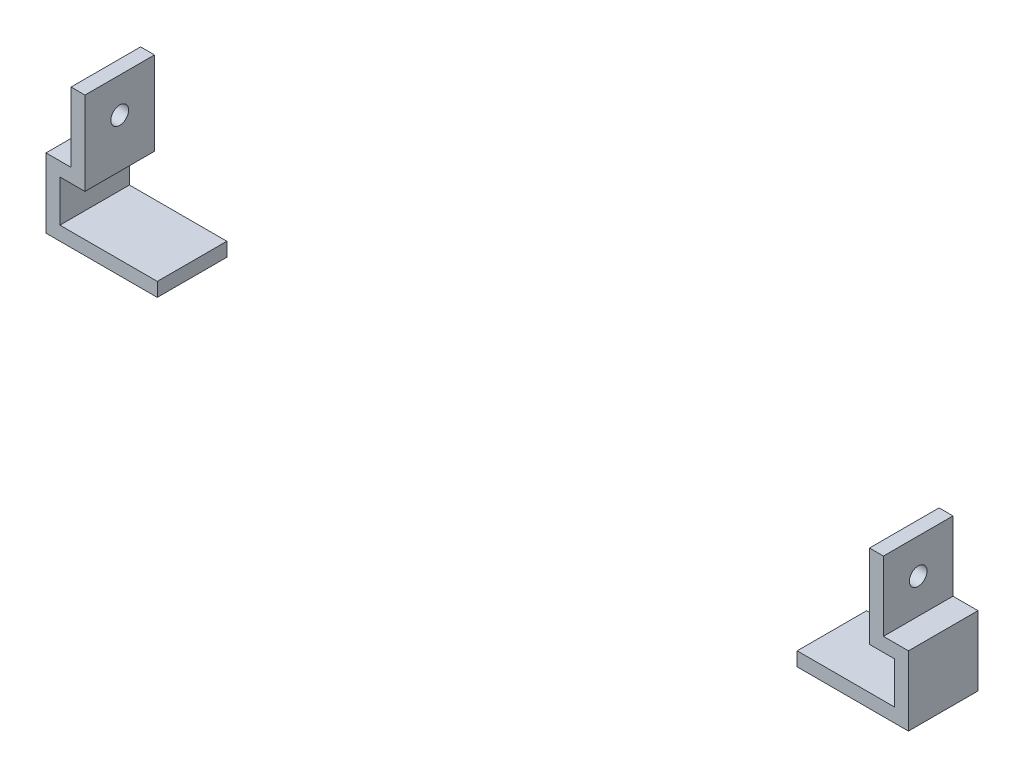
ISO-10303-21;
HEADER;
FILE_DESCRIPTION(('STEP AP214'),'2;1');
FILE_NAME('part.step','',(''),(''),'','','');
FILE_SCHEMA(('AUTOMOTIVE_DESIGN { 1 0 10303 214 1 1 1 1 }'));
ENDSEC;
DATA;
#1=APPLICATION_CONTEXT('core data for automotive mechanical design processes');
#2=APPLICATION_PROTOCOL_DEFINITION('international standard','automotive_design',2000,#1);
#3=PRODUCT_CONTEXT('',#1,'mechanical');
#4=PRODUCT('Part','Part','',(#3));
#5=PRODUCT_RELATED_PRODUCT_CATEGORY('part','',(#4));
#6=PRODUCT_DEFINITION_FORMATION('','',#4);
#7=PRODUCT_DEFINITION_CONTEXT('part definition',#1,'design');
#8=PRODUCT_DEFINITION('design','',#6,#7);
#9=PRODUCT_DEFINITION_SHAPE('','',#8);
#10=(LENGTH_UNIT() NAMED_UNIT(*) SI_UNIT(.MILLI.,.METRE.));
#11=(NAMED_UNIT(*) PLANE_ANGLE_UNIT() SI_UNIT($,.RADIAN.));
#12=(NAMED_UNIT(*) SI_UNIT($,.STERADIAN.) SOLID_ANGLE_UNIT());
#13=UNCERTAINTY_MEASURE_WITH_UNIT(LENGTH_MEASURE(1.E-05),#10,'distance_accuracy_value','');
#14=(GEOMETRIC_REPRESENTATION_CONTEXT(3) GLOBAL_UNCERTAINTY_ASSIGNED_CONTEXT((#13)) GLOBAL_UNIT_ASSIGNED_CONTEXT((#10,
#11,#12)) REPRESENTATION_CONTEXT('',''));
#15=CARTESIAN_POINT('',(0.,0.,0.));
#16=DIRECTION('',(0.,0.,1.));
#17=DIRECTION('',(1.,0.,0.));
#18=AXIS2_PLACEMENT_3D('',#15,#16,#17);
#19=CARTESIAN_POINT('',(0.,-30.,25.));
#20=DIRECTION('',(0.,1.,0.));
#21=DIRECTION('',(0.,0.,1.));
#22=AXIS2_PLACEMENT_3D('',#19,#20,#21);
#23=PLANE('',#22);
#24=DIRECTION('',(1.,0.,0.));
#25=VECTOR('',#24,1.);
#26=CARTESIAN_POINT('',(0.,-30.,0.));
#27=LINE('',#26,#25);
#28=CARTESIAN_POINT('',(115.,-30.,0.));
#29=VERTEX_POINT('',#28);
#30=CARTESIAN_POINT('',(150.,-30.,0.));
#31=VERTEX_POINT('',#30);
#32=EDGE_CURVE('E159',#29,#31,#27,.T.);
#33=ORIENTED_EDGE('',*,*,#32,.F.);
#34=DIRECTION('',(0.,0.,-1.));
#35=VECTOR('',#34,1.);
#36=CARTESIAN_POINT('',(115.,-30.,25.));
#37=LINE('',#36,#35);
#38=CARTESIAN_POINT('',(115.,-30.,25.));
#39=VERTEX_POINT('',#38);
#40=EDGE_CURVE('E12',#39,#29,#37,.T.);
#41=ORIENTED_EDGE('',*,*,#40,.F.);
#42=DIRECTION('',(1.,0.,0.));
#43=VECTOR('',#42,1.);
#44=CARTESIAN_POINT('',(0.,-30.,25.));
#45=LINE('',#44,#43);
#46=CARTESIAN_POINT('',(150.,-30.,25.));
#47=VERTEX_POINT('',#46);
#48=EDGE_CURVE('E185',#39,#47,#45,.T.);
#49=ORIENTED_EDGE('',*,*,#48,.T.);
#50=DIRECTION('',(0.,0.,-1.));
#51=VECTOR('',#50,1.);
#52=CARTESIAN_POINT('',(150.,-30.,25.));
#53=LINE('',#52,#51);
#54=EDGE_CURVE('E68',#47,#31,#53,.T.);
#55=ORIENTED_EDGE('',*,*,#54,.T.);
#56=EDGE_LOOP('',(#33,#41,#49,#55));
#57=FACE_BOUND('',#56,.T.);
#58=ADVANCED_FACE('F51',(#57),#23,.T.);
#59=CARTESIAN_POINT('',(115.,0.,25.));
#60=DIRECTION('',(1.,0.,0.));
#61=DIRECTION('',(0.,0.,-1.));
#62=AXIS2_PLACEMENT_3D('',#59,#60,#61);
#63=PLANE('',#62);
#64=DIRECTION('',(0.,-1.,0.));
#65=VECTOR('',#64,1.);
#66=CARTESIAN_POINT('',(115.,0.,0.));
#67=LINE('',#66,#65);
#68=CARTESIAN_POINT('',(115.,-35.,0.));
#69=VERTEX_POINT('',#68);
#70=EDGE_CURVE('E161',#29,#69,#67,.T.);
#71=ORIENTED_EDGE('',*,*,#70,.T.);
#72=DIRECTION('',(0.,0.,-1.));
#73=VECTOR('',#72,1.);
#74=CARTESIAN_POINT('',(115.,-35.,25.));
#75=LINE('',#74,#73);
#76=CARTESIAN_POINT('',(115.,-35.,25.));
#77=VERTEX_POINT('',#76);
#78=EDGE_CURVE('E60',#77,#69,#75,.T.);
#79=ORIENTED_EDGE('',*,*,#78,.F.);
#80=DIRECTION('',(0.,-1.,0.));
#81=VECTOR('',#80,1.);
#82=CARTESIAN_POINT('',(115.,0.,25.));
#83=LINE('',#82,#81);
#84=EDGE_CURVE('E219',#39,#77,#83,.T.);
#85=ORIENTED_EDGE('',*,*,#84,.F.);
#86=ORIENTED_EDGE('',*,*,#40,.T.);
#87=EDGE_LOOP('',(#71,#79,#85,#86));
#88=FACE_BOUND('',#87,.T.);
#89=ADVANCED_FACE('F206',(#88),#63,.F.);
#90=CARTESIAN_POINT('',(0.,-35.,25.));
#91=DIRECTION('',(0.,-1.,0.));
#92=DIRECTION('',(1.,0.,0.));
#93=AXIS2_PLACEMENT_3D('',#90,#91,#92);
#94=PLANE('',#93);
#95=DIRECTION('',(-1.,0.,0.));
#96=VECTOR('',#95,1.);
#97=CARTESIAN_POINT('',(0.,-35.,0.));
#98=LINE('',#97,#96);
#99=CARTESIAN_POINT('',(155.,-35.,0.));
#100=VERTEX_POINT('',#99);
#101=EDGE_CURVE('E164',#100,#69,#98,.T.);
#102=ORIENTED_EDGE('',*,*,#101,.F.);
#103=DIRECTION('',(0.,0.,-1.));
#104=VECTOR('',#103,1.);
#105=CARTESIAN_POINT('',(155.,-35.,25.));
#106=LINE('',#105,#104);
#107=CARTESIAN_POINT('',(155.,-35.,25.));
#108=VERTEX_POINT('',#107);
#109=EDGE_CURVE('E195',#108,#100,#106,.T.);
#110=ORIENTED_EDGE('',*,*,#109,.F.);
#111=DIRECTION('',(-1.,0.,0.));
#112=VECTOR('',#111,1.);
#113=CARTESIAN_POINT('',(0.,-35.,25.));
#114=LINE('',#113,#112);
#115=EDGE_CURVE('E203',#108,#77,#114,.T.);
#116=ORIENTED_EDGE('',*,*,#115,.T.);
#117=ORIENTED_EDGE('',*,*,#78,.T.);
#118=EDGE_LOOP('',(#102,#110,#116,#117));
#119=FACE_BOUND('',#118,.T.);
#120=ADVANCED_FACE('F201',(#119),#94,.T.);
#121=CARTESIAN_POINT('',(155.,0.,25.));
#122=DIRECTION('',(1.,0.,0.));
#123=DIRECTION('',(0.,0.,-1.));
#124=AXIS2_PLACEMENT_3D('',#121,#122,#123);
#125=PLANE('',#124);
#126=DIRECTION('',(0.,-1.,0.));
#127=VECTOR('',#126,1.);
#128=CARTESIAN_POINT('',(155.,0.,0.));
#129=LINE('',#128,#127);
#130=CARTESIAN_POINT('',(155.,-10.,0.));
#131=VERTEX_POINT('',#130);
#132=EDGE_CURVE('E167',#131,#100,#129,.T.);
#133=ORIENTED_EDGE('',*,*,#132,.F.);
#134=DIRECTION('',(0.,0.,-1.));
#135=VECTOR('',#134,1.);
#136=CARTESIAN_POINT('',(155.,-10.,25.));
#137=LINE('',#136,#135);
#138=CARTESIAN_POINT('',(155.,-10.,25.));
#139=VERTEX_POINT('',#138);
#140=EDGE_CURVE('E193',#139,#131,#137,.T.);
#141=ORIENTED_EDGE('',*,*,#140,.F.);
#142=DIRECTION('',(0.,-1.,0.));
#143=VECTOR('',#142,1.);
#144=CARTESIAN_POINT('',(155.,0.,25.));
#145=LINE('',#144,#143);
#146=EDGE_CURVE('E216',#139,#108,#145,.T.);
#147=ORIENTED_EDGE('',*,*,#146,.T.);
#148=ORIENTED_EDGE('',*,*,#109,.T.);
#149=EDGE_LOOP('',(#133,#141,#147,#148));
#150=FACE_BOUND('',#149,.T.);
#151=ADVANCED_FACE('F213',(#150),#125,.T.);
#152=CARTESIAN_POINT('',(0.,-10.,25.));
#153=DIRECTION('',(0.,1.,0.));
#154=DIRECTION('',(0.,0.,1.));
#155=AXIS2_PLACEMENT_3D('',#152,#153,#154);
#156=PLANE('',#155);
#157=DIRECTION('',(1.,0.,0.));
#158=VECTOR('',#157,1.);
#159=CARTESIAN_POINT('',(0.,-10.,0.));
#160=LINE('',#159,#158);
#161=CARTESIAN_POINT('',(146.,-10.,0.));
#162=VERTEX_POINT('',#161);
#163=EDGE_CURVE('E170',#162,#131,#160,.T.);
#164=ORIENTED_EDGE('',*,*,#163,.F.);
#165=DIRECTION('',(0.,0.,-1.));
#166=VECTOR('',#165,1.);
#167=CARTESIAN_POINT('',(146.,-10.,25.));
#168=LINE('',#167,#166);
#169=CARTESIAN_POINT('',(146.,-10.,25.));
#170=VERTEX_POINT('',#169);
#171=EDGE_CURVE('E191',#170,#162,#168,.T.);
#172=ORIENTED_EDGE('',*,*,#171,.F.);
#173=DIRECTION('',(1.,0.,0.));
#174=VECTOR('',#173,1.);
#175=CARTESIAN_POINT('',(0.,-10.,25.));
#176=LINE('',#175,#174);
#177=EDGE_CURVE('E221',#170,#139,#176,.T.);
#178=ORIENTED_EDGE('',*,*,#177,.T.);
#179=ORIENTED_EDGE('',*,*,#140,.T.);
#180=EDGE_LOOP('',(#164,#172,#178,#179));
#181=FACE_BOUND('',#180,.T.);
#182=ADVANCED_FACE('F254',(#181),#156,.T.);
#183=CARTESIAN_POINT('',(146.,0.,25.));
#184=DIRECTION('',(-1.,0.,0.));
#185=DIRECTION('',(0.,0.,1.));
#186=AXIS2_PLACEMENT_3D('',#183,#184,#185);
#187=PLANE('',#186);
#188=CARTESIAN_POINT('',(146.,2.5,12.5));
#189=DIRECTION('',(1.,0.,0.));
#190=DIRECTION('',(0.,0.,-1.));
#191=AXIS2_PLACEMENT_3D('',#188,#189,#190);
#192=CIRCLE('',#191,3.175);
#193=CARTESIAN_POINT('',(146.,2.5,9.325));
#194=VERTEX_POINT('',#193);
#195=EDGE_CURVE('E270',#194,#194,#192,.T.);
#196=ORIENTED_EDGE('',*,*,#195,.F.);
#197=EDGE_LOOP('',(#196));
#198=FACE_BOUND('',#197,.T.);
#199=DIRECTION('',(0.,1.,0.));
#200=VECTOR('',#199,1.);
#201=CARTESIAN_POINT('',(146.,0.,0.));
#202=LINE('',#201,#200);
#203=CARTESIAN_POINT('',(146.,15.,0.));
#204=VERTEX_POINT('',#203);
#205=EDGE_CURVE('E173',#162,#204,#202,.T.);
#206=ORIENTED_EDGE('',*,*,#205,.T.);
#207=DIRECTION('',(0.,0.,-1.));
#208=VECTOR('',#207,1.);
#209=CARTESIAN_POINT('',(146.,15.,25.));
#210=LINE('',#209,#208);
#211=CARTESIAN_POINT('',(146.,15.,25.));
#212=VERTEX_POINT('',#211);
#213=EDGE_CURVE('E189',#212,#204,#210,.T.);
#214=ORIENTED_EDGE('',*,*,#213,.F.);
#215=DIRECTION('',(0.,1.,0.));
#216=VECTOR('',#215,1.);
#217=CARTESIAN_POINT('',(146.,0.,25.));
#218=LINE('',#217,#216);
#219=EDGE_CURVE('E154',#170,#212,#218,.T.);
#220=ORIENTED_EDGE('',*,*,#219,.F.);
#221=ORIENTED_EDGE('',*,*,#171,.T.);
#222=EDGE_LOOP('',(#206,#214,#220,#221));
#223=FACE_BOUND('',#222,.T.);
#224=ADVANCED_FACE('F229',(#198,#223),#187,.F.);
#225=CARTESIAN_POINT('',(0.,15.,25.));
#226=DIRECTION('',(0.,1.,0.));
#227=DIRECTION('',(0.,0.,1.));
#228=AXIS2_PLACEMENT_3D('',#225,#226,#227);
#229=PLANE('',#228);
#230=DIRECTION('',(1.,0.,0.));
#231=VECTOR('',#230,1.);
#232=CARTESIAN_POINT('',(0.,15.,0.));
#233=LINE('',#232,#231);
#234=CARTESIAN_POINT('',(141.,15.,0.));
#235=VERTEX_POINT('',#234);
#236=EDGE_CURVE('E176',#235,#204,#233,.T.);
#237=ORIENTED_EDGE('',*,*,#236,.F.);
#238=DIRECTION('',(0.,0.,-1.));
#239=VECTOR('',#238,1.);
#240=CARTESIAN_POINT('',(141.,15.,25.));
#241=LINE('',#240,#239);
#242=CARTESIAN_POINT('',(141.,15.,25.));
#243=VERTEX_POINT('',#242);
#244=EDGE_CURVE('E140',#243,#235,#241,.T.);
#245=ORIENTED_EDGE('',*,*,#244,.F.);
#246=DIRECTION('',(1.,0.,0.));
#247=VECTOR('',#246,1.);
#248=CARTESIAN_POINT('',(0.,15.,25.));
#249=LINE('',#248,#247);
#250=EDGE_CURVE('E152',#243,#212,#249,.T.);
#251=ORIENTED_EDGE('',*,*,#250,.T.);
#252=ORIENTED_EDGE('',*,*,#213,.T.);
#253=EDGE_LOOP('',(#237,#245,#251,#252));
#254=FACE_BOUND('',#253,.T.);
#255=ADVANCED_FACE('F232',(#254),#229,.T.);
#256=CARTESIAN_POINT('',(141.,0.,25.));
#257=DIRECTION('',(-1.,0.,0.));
#258=DIRECTION('',(0.,0.,1.));
#259=AXIS2_PLACEMENT_3D('',#256,#257,#258);
#260=PLANE('',#259);
#261=CARTESIAN_POINT('',(141.,2.5,12.5));
#262=DIRECTION('',(-1.,0.,0.));
#263=DIRECTION('',(0.,0.,1.));
#264=AXIS2_PLACEMENT_3D('',#261,#262,#263);
#265=CIRCLE('',#264,3.175);
#266=CARTESIAN_POINT('',(141.,2.5,15.675));
#267=VERTEX_POINT('',#266);
#268=EDGE_CURVE('E54',#267,#267,#265,.T.);
#269=ORIENTED_EDGE('',*,*,#268,.F.);
#270=EDGE_LOOP('',(#269));
#271=FACE_BOUND('',#270,.T.);
#272=DIRECTION('',(0.,1.,0.));
#273=VECTOR('',#272,1.);
#274=CARTESIAN_POINT('',(141.,0.,0.));
#275=LINE('',#274,#273);
#276=CARTESIAN_POINT('',(141.,-15.,0.));
#277=VERTEX_POINT('',#276);
#278=EDGE_CURVE('E137',#277,#235,#275,.T.);
#279=ORIENTED_EDGE('',*,*,#278,.F.);
#280=DIRECTION('',(0.,0.,-1.));
#281=VECTOR('',#280,1.);
#282=CARTESIAN_POINT('',(141.,-15.,25.));
#283=LINE('',#282,#281);
#284=CARTESIAN_POINT('',(141.,-15.,25.));
#285=VERTEX_POINT('',#284);
#286=EDGE_CURVE('E131',#285,#277,#283,.T.);
#287=ORIENTED_EDGE('',*,*,#286,.F.);
#288=DIRECTION('',(0.,1.,0.));
#289=VECTOR('',#288,1.);
#290=CARTESIAN_POINT('',(141.,0.,25.));
#291=LINE('',#290,#289);
#292=EDGE_CURVE('E135',#285,#243,#291,.T.);
#293=ORIENTED_EDGE('',*,*,#292,.T.);
#294=ORIENTED_EDGE('',*,*,#244,.T.);
#295=EDGE_LOOP('',(#279,#287,#293,#294));
#296=FACE_BOUND('',#295,.T.);
#297=ADVANCED_FACE('F133',(#271,#296),#260,.T.);
#298=CARTESIAN_POINT('',(0.,-15.,25.));
#299=DIRECTION('',(0.,1.,0.));
#300=DIRECTION('',(0.,0.,1.));
#301=AXIS2_PLACEMENT_3D('',#298,#299,#300);
#302=PLANE('',#301);
#303=DIRECTION('',(1.,0.,0.));
#304=VECTOR('',#303,1.);
#305=CARTESIAN_POINT('',(0.,-15.,0.));
#306=LINE('',#305,#304);
#307=CARTESIAN_POINT('',(150.,-15.,0.));
#308=VERTEX_POINT('',#307);
#309=EDGE_CURVE('E180',#277,#308,#306,.T.);
#310=ORIENTED_EDGE('',*,*,#309,.T.);
#311=DIRECTION('',(0.,0.,-1.));
#312=VECTOR('',#311,1.);
#313=CARTESIAN_POINT('',(150.,-15.,25.));
#314=LINE('',#313,#312);
#315=CARTESIAN_POINT('',(150.,-15.,25.));
#316=VERTEX_POINT('',#315);
#317=EDGE_CURVE('E100',#316,#308,#314,.T.);
#318=ORIENTED_EDGE('',*,*,#317,.F.);
#319=DIRECTION('',(1.,0.,0.));
#320=VECTOR('',#319,1.);
#321=CARTESIAN_POINT('',(0.,-15.,25.));
#322=LINE('',#321,#320);
#323=EDGE_CURVE('E142',#285,#316,#322,.T.);
#324=ORIENTED_EDGE('',*,*,#323,.F.);
#325=ORIENTED_EDGE('',*,*,#286,.T.);
#326=EDGE_LOOP('',(#310,#318,#324,#325));
#327=FACE_BOUND('',#326,.T.);
#328=ADVANCED_FACE('F143',(#327),#302,.F.);
#329=CARTESIAN_POINT('',(150.,0.,25.));
#330=DIRECTION('',(-1.,0.,0.));
#331=DIRECTION('',(0.,0.,1.));
#332=AXIS2_PLACEMENT_3D('',#329,#330,#331);
#333=PLANE('',#332);
#334=DIRECTION('',(0.,1.,0.));
#335=VECTOR('',#334,1.);
#336=CARTESIAN_POINT('',(150.,0.,0.));
#337=LINE('',#336,#335);
#338=EDGE_CURVE('E182',#31,#308,#337,.T.);
#339=ORIENTED_EDGE('',*,*,#338,.F.);
#340=ORIENTED_EDGE('',*,*,#54,.F.);
#341=DIRECTION('',(0.,1.,0.));
#342=VECTOR('',#341,1.);
#343=CARTESIAN_POINT('',(150.,0.,25.));
#344=LINE('',#343,#342);
#345=EDGE_CURVE('E146',#47,#316,#344,.T.);
#346=ORIENTED_EDGE('',*,*,#345,.T.);
#347=ORIENTED_EDGE('',*,*,#317,.T.);
#348=EDGE_LOOP('',(#339,#340,#346,#347));
#349=FACE_BOUND('',#348,.T.);
#350=ADVANCED_FACE('F233',(#349),#333,.T.);
#351=CARTESIAN_POINT('',(0.,0.,25.));
#352=DIRECTION('',(0.,0.,1.));
#353=DIRECTION('',(1.,0.,0.));
#354=AXIS2_PLACEMENT_3D('',#351,#352,#353);
#355=PLANE('',#354);
#356=ORIENTED_EDGE('',*,*,#48,.F.);
#357=ORIENTED_EDGE('',*,*,#84,.T.);
#358=ORIENTED_EDGE('',*,*,#115,.F.);
#359=ORIENTED_EDGE('',*,*,#146,.F.);
#360=ORIENTED_EDGE('',*,*,#177,.F.);
#361=ORIENTED_EDGE('',*,*,#219,.T.);
#362=ORIENTED_EDGE('',*,*,#250,.F.);
#363=ORIENTED_EDGE('',*,*,#292,.F.);
#364=ORIENTED_EDGE('',*,*,#323,.T.);
#365=ORIENTED_EDGE('',*,*,#345,.F.);
#366=EDGE_LOOP('',(#356,#357,#358,#359,#360,#361,#362,#363,#364,#365));
#367=FACE_BOUND('',#366,.T.);
#368=ADVANCED_FACE('F150',(#367),#355,.T.);
#369=CARTESIAN_POINT('',(0.,0.,0.));
#370=DIRECTION('',(0.,0.,1.));
#371=DIRECTION('',(1.,0.,0.));
#372=AXIS2_PLACEMENT_3D('',#369,#370,#371);
#373=PLANE('',#372);
#374=ORIENTED_EDGE('',*,*,#32,.T.);
#375=ORIENTED_EDGE('',*,*,#338,.T.);
#376=ORIENTED_EDGE('',*,*,#309,.F.);
#377=ORIENTED_EDGE('',*,*,#278,.T.);
#378=ORIENTED_EDGE('',*,*,#236,.T.);
#379=ORIENTED_EDGE('',*,*,#205,.F.);
#380=ORIENTED_EDGE('',*,*,#163,.T.);
#381=ORIENTED_EDGE('',*,*,#132,.T.);
#382=ORIENTED_EDGE('',*,*,#101,.T.);
#383=ORIENTED_EDGE('',*,*,#70,.F.);
#384=EDGE_LOOP('',(#374,#375,#376,#377,#378,#379,#380,#381,#382,#383));
#385=FACE_BOUND('',#384,.T.);
#386=ADVANCED_FACE('F208',(#385),#373,.F.);
#387=CARTESIAN_POINT('',(-155.,2.5,12.5));
#388=DIRECTION('',(1.,0.,0.));
#389=DIRECTION('',(0.,0.,-1.));
#390=AXIS2_PLACEMENT_3D('',#387,#388,#389);
#391=CYLINDRICAL_SURFACE('',#390,3.175);
#392=ORIENTED_EDGE('',*,*,#268,.T.);
#393=EDGE_LOOP('',(#392));
#394=FACE_BOUND('',#393,.T.);
#395=ORIENTED_EDGE('',*,*,#195,.T.);
#396=EDGE_LOOP('',(#395));
#397=FACE_BOUND('',#396,.T.);
#398=ADVANCED_FACE('F275',(#394,#397),#391,.F.);
#399=CLOSED_SHELL('',(#58,#89,#120,#151,#182,#224,#255,#297,#328,#350,#368,#386,#398));
#400=MANIFOLD_SOLID_BREP('B2',#399);
#401=CARTESIAN_POINT('',(-115.,0.,25.));
#402=DIRECTION('',(1.,0.,0.));
#403=DIRECTION('',(0.,0.,-1.));
#404=AXIS2_PLACEMENT_3D('',#401,#402,#403);
#405=PLANE('',#404);
#406=DIRECTION('',(0.,-1.,0.));
#407=VECTOR('',#406,1.);
#408=CARTESIAN_POINT('',(-115.,0.,0.));
#409=LINE('',#408,#407);
#410=CARTESIAN_POINT('',(-115.,-30.,0.));
#411=VERTEX_POINT('',#410);
#412=CARTESIAN_POINT('',(-115.,-35.,0.));
#413=VERTEX_POINT('',#412);
#414=EDGE_CURVE('E516',#411,#413,#409,.T.);
#415=ORIENTED_EDGE('',*,*,#414,.F.);
#416=DIRECTION('',(0.,0.,-1.));
#417=VECTOR('',#416,1.);
#418=CARTESIAN_POINT('',(-115.,-30.,25.));
#419=LINE('',#418,#417);
#420=CARTESIAN_POINT('',(-115.,-30.,25.));
#421=VERTEX_POINT('',#420);
#422=EDGE_CURVE('E49',#421,#411,#419,.T.);
#423=ORIENTED_EDGE('',*,*,#422,.F.);
#424=DIRECTION('',(0.,-1.,0.));
#425=VECTOR('',#424,1.);
#426=CARTESIAN_POINT('',(-115.,0.,25.));
#427=LINE('',#426,#425);
#428=CARTESIAN_POINT('',(-115.,-35.,25.));
#429=VERTEX_POINT('',#428);
#430=EDGE_CURVE('E551',#421,#429,#427,.T.);
#431=ORIENTED_EDGE('',*,*,#430,.T.);
#432=DIRECTION('',(0.,0.,-1.));
#433=VECTOR('',#432,1.);
#434=CARTESIAN_POINT('',(-115.,-35.,25.));
#435=LINE('',#434,#433);
#436=EDGE_CURVE('E465',#429,#413,#435,.T.);
#437=ORIENTED_EDGE('',*,*,#436,.T.);
#438=EDGE_LOOP('',(#415,#423,#431,#437));
#439=FACE_BOUND('',#438,.T.);
#440=ADVANCED_FACE('F406',(#439),#405,.T.);
#441=CARTESIAN_POINT('',(0.,-30.,25.));
#442=DIRECTION('',(0.,-1.,0.));
#443=DIRECTION('',(1.,0.,0.));
#444=AXIS2_PLACEMENT_3D('',#441,#442,#443);
#445=PLANE('',#444);
#446=DIRECTION('',(-1.,0.,0.));
#447=VECTOR('',#446,1.);
#448=CARTESIAN_POINT('',(0.,-30.,0.));
#449=LINE('',#448,#447);
#450=CARTESIAN_POINT('',(-150.,-30.,0.));
#451=VERTEX_POINT('',#450);
#452=EDGE_CURVE('E520',#411,#451,#449,.T.);
#453=ORIENTED_EDGE('',*,*,#452,.T.);
#454=DIRECTION('',(0.,0.,-1.));
#455=VECTOR('',#454,1.);
#456=CARTESIAN_POINT('',(-150.,-30.,25.));
#457=LINE('',#456,#455);
#458=CARTESIAN_POINT('',(-150.,-30.,25.));
#459=VERTEX_POINT('',#458);
#460=EDGE_CURVE('E416',#459,#451,#457,.T.);
#461=ORIENTED_EDGE('',*,*,#460,.F.);
#462=DIRECTION('',(-1.,0.,0.));
#463=VECTOR('',#462,1.);
#464=CARTESIAN_POINT('',(0.,-30.,25.));
#465=LINE('',#464,#463);
#466=EDGE_CURVE('E593',#421,#459,#465,.T.);
#467=ORIENTED_EDGE('',*,*,#466,.F.);
#468=ORIENTED_EDGE('',*,*,#422,.T.);
#469=EDGE_LOOP('',(#453,#461,#467,#468));
#470=FACE_BOUND('',#469,.T.);
#471=ADVANCED_FACE('F581',(#470),#445,.F.);
#472=CARTESIAN_POINT('',(-150.,0.,25.));
#473=DIRECTION('',(1.,0.,0.));
#474=DIRECTION('',(0.,0.,-1.));
#475=AXIS2_PLACEMENT_3D('',#472,#473,#474);
#476=PLANE('',#475);
#477=DIRECTION('',(0.,-1.,0.));
#478=VECTOR('',#477,1.);
#479=CARTESIAN_POINT('',(-150.,0.,0.));
#480=LINE('',#479,#478);
#481=CARTESIAN_POINT('',(-150.,-15.,0.));
#482=VERTEX_POINT('',#481);
#483=EDGE_CURVE('E525',#482,#451,#480,.T.);
#484=ORIENTED_EDGE('',*,*,#483,.F.);
#485=DIRECTION('',(0.,0.,-1.));
#486=VECTOR('',#485,1.);
#487=CARTESIAN_POINT('',(-150.,-15.,25.));
#488=LINE('',#487,#486);
#489=CARTESIAN_POINT('',(-150.,-15.,25.));
#490=VERTEX_POINT('',#489);
#491=EDGE_CURVE('E568',#490,#482,#488,.T.);
#492=ORIENTED_EDGE('',*,*,#491,.F.);
#493=DIRECTION('',(0.,-1.,0.));
#494=VECTOR('',#493,1.);
#495=CARTESIAN_POINT('',(-150.,0.,25.));
#496=LINE('',#495,#494);
#497=EDGE_CURVE('E578',#490,#459,#496,.T.);
#498=ORIENTED_EDGE('',*,*,#497,.T.);
#499=ORIENTED_EDGE('',*,*,#460,.T.);
#500=EDGE_LOOP('',(#484,#492,#498,#499));
#501=FACE_BOUND('',#500,.T.);
#502=ADVANCED_FACE('F576',(#501),#476,.T.);
#503=CARTESIAN_POINT('',(0.,-15.,25.));
#504=DIRECTION('',(0.,-1.,0.));
#505=DIRECTION('',(1.,0.,0.));
#506=AXIS2_PLACEMENT_3D('',#503,#504,#505);
#507=PLANE('',#506);
#508=DIRECTION('',(-1.,0.,0.));
#509=VECTOR('',#508,1.);
#510=CARTESIAN_POINT('',(0.,-15.,0.));
#511=LINE('',#510,#509);
#512=CARTESIAN_POINT('',(-141.,-15.,0.));
#513=VERTEX_POINT('',#512);
#514=EDGE_CURVE('E529',#513,#482,#511,.T.);
#515=ORIENTED_EDGE('',*,*,#514,.F.);
#516=DIRECTION('',(0.,0.,-1.));
#517=VECTOR('',#516,1.);
#518=CARTESIAN_POINT('',(-141.,-15.,25.));
#519=LINE('',#518,#517);
#520=CARTESIAN_POINT('',(-141.,-15.,25.));
#521=VERTEX_POINT('',#520);
#522=EDGE_CURVE('E565',#521,#513,#519,.T.);
#523=ORIENTED_EDGE('',*,*,#522,.F.);
#524=DIRECTION('',(-1.,0.,0.));
#525=VECTOR('',#524,1.);
#526=CARTESIAN_POINT('',(0.,-15.,25.));
#527=LINE('',#526,#525);
#528=EDGE_CURVE('E592',#521,#490,#527,.T.);
#529=ORIENTED_EDGE('',*,*,#528,.T.);
#530=ORIENTED_EDGE('',*,*,#491,.T.);
#531=EDGE_LOOP('',(#515,#523,#529,#530));
#532=FACE_BOUND('',#531,.T.);
#533=ADVANCED_FACE('F588',(#532),#507,.T.);
#534=CARTESIAN_POINT('',(-141.,0.,25.));
#535=DIRECTION('',(-1.,0.,0.));
#536=DIRECTION('',(0.,0.,1.));
#537=AXIS2_PLACEMENT_3D('',#534,#535,#536);
#538=PLANE('',#537);
#539=CARTESIAN_POINT('',(-141.,2.5,12.5));
#540=DIRECTION('',(-1.,0.,0.));
#541=DIRECTION('',(0.,0.,1.));
#542=AXIS2_PLACEMENT_3D('',#539,#540,#541);
#543=CIRCLE('',#542,3.175);
#544=CARTESIAN_POINT('',(-141.,2.5,15.675));
#545=VERTEX_POINT('',#544);
#546=EDGE_CURVE('E521',#545,#545,#543,.T.);
#547=ORIENTED_EDGE('',*,*,#546,.T.);
#548=EDGE_LOOP('',(#547));
#549=FACE_BOUND('',#548,.T.);
#550=DIRECTION('',(0.,1.,0.));
#551=VECTOR('',#550,1.);
#552=CARTESIAN_POINT('',(-141.,0.,0.));
#553=LINE('',#552,#551);
#554=CARTESIAN_POINT('',(-141.,15.,0.));
#555=VERTEX_POINT('',#554);
#556=EDGE_CURVE('E533',#513,#555,#553,.T.);
#557=ORIENTED_EDGE('',*,*,#556,.T.);
#558=DIRECTION('',(0.,0.,-1.));
#559=VECTOR('',#558,1.);
#560=CARTESIAN_POINT('',(-141.,15.,25.));
#561=LINE('',#560,#559);
#562=CARTESIAN_POINT('',(-141.,15.,25.));
#563=VERTEX_POINT('',#562);
#564=EDGE_CURVE('E561',#563,#555,#561,.T.);
#565=ORIENTED_EDGE('',*,*,#564,.F.);
#566=DIRECTION('',(0.,1.,0.));
#567=VECTOR('',#566,1.);
#568=CARTESIAN_POINT('',(-141.,0.,25.));
#569=LINE('',#568,#567);
#570=EDGE_CURVE('E598',#521,#563,#569,.T.);
#571=ORIENTED_EDGE('',*,*,#570,.F.);
#572=ORIENTED_EDGE('',*,*,#522,.T.);
#573=EDGE_LOOP('',(#557,#565,#571,#572));
#574=FACE_BOUND('',#573,.T.);
#575=ADVANCED_FACE('F636',(#549,#574),#538,.F.);
#576=CARTESIAN_POINT('',(0.,14.9999999999999,25.));
#577=DIRECTION('',(0.,-1.,0.));
#578=DIRECTION('',(1.,0.,0.));
#579=AXIS2_PLACEMENT_3D('',#576,#577,#578);
#580=PLANE('',#579);
#581=DIRECTION('',(-1.,0.,0.));
#582=VECTOR('',#581,1.);
#583=CARTESIAN_POINT('',(0.,14.9999999999999,0.));
#584=LINE('',#583,#582);
#585=CARTESIAN_POINT('',(-146.,15.,0.));
#586=VERTEX_POINT('',#585);
#587=EDGE_CURVE('E536',#555,#586,#584,.T.);
#588=ORIENTED_EDGE('',*,*,#587,.T.);
#589=DIRECTION('',(0.,0.,-1.));
#590=VECTOR('',#589,1.);
#591=CARTESIAN_POINT('',(-146.,15.,25.));
#592=LINE('',#591,#590);
#593=CARTESIAN_POINT('',(-146.,15.,25.));
#594=VERTEX_POINT('',#593);
#595=EDGE_CURVE('E558',#594,#586,#592,.T.);
#596=ORIENTED_EDGE('',*,*,#595,.F.);
#597=DIRECTION('',(-1.,0.,0.));
#598=VECTOR('',#597,1.);
#599=CARTESIAN_POINT('',(0.,14.9999999999999,25.));
#600=LINE('',#599,#598);
#601=EDGE_CURVE('E605',#563,#594,#600,.T.);
#602=ORIENTED_EDGE('',*,*,#601,.F.);
#603=ORIENTED_EDGE('',*,*,#564,.T.);
#604=EDGE_LOOP('',(#588,#596,#602,#603));
#605=FACE_BOUND('',#604,.T.);
#606=ADVANCED_FACE('F629',(#605),#580,.F.);
#607=CARTESIAN_POINT('',(-146.,0.,25.));
#608=DIRECTION('',(-1.,0.,0.));
#609=DIRECTION('',(0.,0.,1.));
#610=AXIS2_PLACEMENT_3D('',#607,#608,#609);
#611=PLANE('',#610);
#612=CARTESIAN_POINT('',(-146.,2.5,12.5));
#613=DIRECTION('',(-1.,0.,0.));
#614=DIRECTION('',(0.,0.,1.));
#615=AXIS2_PLACEMENT_3D('',#612,#613,#614);
#616=CIRCLE('',#615,3.175);
#617=CARTESIAN_POINT('',(-146.,2.5,15.675));
#618=VERTEX_POINT('',#617);
#619=EDGE_CURVE('E409',#618,#618,#616,.T.);
#620=ORIENTED_EDGE('',*,*,#619,.F.);
#621=EDGE_LOOP('',(#620));
#622=FACE_BOUND('',#621,.T.);
#623=DIRECTION('',(0.,1.,0.));
#624=VECTOR('',#623,1.);
#625=CARTESIAN_POINT('',(-146.,0.,0.));
#626=LINE('',#625,#624);
#627=CARTESIAN_POINT('',(-146.,-10.,0.));
#628=VERTEX_POINT('',#627);
#629=EDGE_CURVE('E540',#628,#586,#626,.T.);
#630=ORIENTED_EDGE('',*,*,#629,.F.);
#631=DIRECTION('',(0.,0.,-1.));
#632=VECTOR('',#631,1.);
#633=CARTESIAN_POINT('',(-146.,-10.,25.));
#634=LINE('',#633,#632);
#635=CARTESIAN_POINT('',(-146.,-10.,25.));
#636=VERTEX_POINT('',#635);
#637=EDGE_CURVE('E506',#636,#628,#634,.T.);
#638=ORIENTED_EDGE('',*,*,#637,.F.);
#639=DIRECTION('',(0.,1.,0.));
#640=VECTOR('',#639,1.);
#641=CARTESIAN_POINT('',(-146.,0.,25.));
#642=LINE('',#641,#640);
#643=EDGE_CURVE('E497',#636,#594,#642,.T.);
#644=ORIENTED_EDGE('',*,*,#643,.T.);
#645=ORIENTED_EDGE('',*,*,#595,.T.);
#646=EDGE_LOOP('',(#630,#638,#644,#645));
#647=FACE_BOUND('',#646,.T.);
#648=ADVANCED_FACE('F610',(#622,#647),#611,.T.);
#649=CARTESIAN_POINT('',(0.,-10.,25.));
#650=DIRECTION('',(0.,-1.,0.));
#651=DIRECTION('',(0.,0.,-1.));
#652=AXIS2_PLACEMENT_3D('',#649,#650,#651);
#653=PLANE('',#652);
#654=DIRECTION('',(-1.,0.,0.));
#655=VECTOR('',#654,1.);
#656=CARTESIAN_POINT('',(0.,-10.,0.));
#657=LINE('',#656,#655);
#658=CARTESIAN_POINT('',(-155.,-10.,0.));
#659=VERTEX_POINT('',#658);
#660=EDGE_CURVE('E504',#628,#659,#657,.T.);
#661=ORIENTED_EDGE('',*,*,#660,.T.);
#662=DIRECTION('',(0.,0.,-1.));
#663=VECTOR('',#662,1.);
#664=CARTESIAN_POINT('',(-155.,-10.,25.));
#665=LINE('',#664,#663);
#666=CARTESIAN_POINT('',(-155.,-10.,25.));
#667=VERTEX_POINT('',#666);
#668=EDGE_CURVE('E501',#667,#659,#665,.T.);
#669=ORIENTED_EDGE('',*,*,#668,.F.);
#670=DIRECTION('',(-1.,0.,0.));
#671=VECTOR('',#670,1.);
#672=CARTESIAN_POINT('',(0.,-10.,25.));
#673=LINE('',#672,#671);
#674=EDGE_CURVE('E491',#636,#667,#673,.T.);
#675=ORIENTED_EDGE('',*,*,#674,.F.);
#676=ORIENTED_EDGE('',*,*,#637,.T.);
#677=EDGE_LOOP('',(#661,#669,#675,#676));
#678=FACE_BOUND('',#677,.T.);
#679=ADVANCED_FACE('F502',(#678),#653,.F.);
#680=CARTESIAN_POINT('',(-155.,0.,25.));
#681=DIRECTION('',(1.,0.,0.));
#682=DIRECTION('',(0.,0.,-1.));
#683=AXIS2_PLACEMENT_3D('',#680,#681,#682);
#684=PLANE('',#683);
#685=DIRECTION('',(0.,-1.,0.));
#686=VECTOR('',#685,1.);
#687=CARTESIAN_POINT('',(-155.,0.,0.));
#688=LINE('',#687,#686);
#689=CARTESIAN_POINT('',(-155.,-35.,0.));
#690=VERTEX_POINT('',#689);
#691=EDGE_CURVE('E458',#659,#690,#688,.T.);
#692=ORIENTED_EDGE('',*,*,#691,.T.);
#693=DIRECTION('',(0.,0.,-1.));
#694=VECTOR('',#693,1.);
#695=CARTESIAN_POINT('',(-155.,-35.,25.));
#696=LINE('',#695,#694);
#697=CARTESIAN_POINT('',(-155.,-35.,25.));
#698=VERTEX_POINT('',#697);
#699=EDGE_CURVE('E507',#698,#690,#696,.T.);
#700=ORIENTED_EDGE('',*,*,#699,.F.);
#701=DIRECTION('',(0.,-1.,0.));
#702=VECTOR('',#701,1.);
#703=CARTESIAN_POINT('',(-155.,0.,25.));
#704=LINE('',#703,#702);
#705=EDGE_CURVE('E495',#667,#698,#704,.T.);
#706=ORIENTED_EDGE('',*,*,#705,.F.);
#707=ORIENTED_EDGE('',*,*,#668,.T.);
#708=EDGE_LOOP('',(#692,#700,#706,#707));
#709=FACE_BOUND('',#708,.T.);
#710=ADVANCED_FACE('F509',(#709),#684,.F.);
#711=CARTESIAN_POINT('',(0.,-35.,25.));
#712=DIRECTION('',(0.,1.,0.));
#713=DIRECTION('',(0.,0.,1.));
#714=AXIS2_PLACEMENT_3D('',#711,#712,#713);
#715=PLANE('',#714);
#716=DIRECTION('',(1.,0.,0.));
#717=VECTOR('',#716,1.);
#718=CARTESIAN_POINT('',(0.,-35.,0.));
#719=LINE('',#718,#717);
#720=EDGE_CURVE('E548',#690,#413,#719,.T.);
#721=ORIENTED_EDGE('',*,*,#720,.T.);
#722=ORIENTED_EDGE('',*,*,#436,.F.);
#723=DIRECTION('',(1.,0.,0.));
#724=VECTOR('',#723,1.);
#725=CARTESIAN_POINT('',(0.,-35.,25.));
#726=LINE('',#725,#724);
#727=EDGE_CURVE('E424',#698,#429,#726,.T.);
#728=ORIENTED_EDGE('',*,*,#727,.F.);
#729=ORIENTED_EDGE('',*,*,#699,.T.);
#730=EDGE_LOOP('',(#721,#722,#728,#729));
#731=FACE_BOUND('',#730,.T.);
#732=ADVANCED_FACE('F614',(#731),#715,.F.);
#733=CARTESIAN_POINT('',(0.,0.,25.));
#734=DIRECTION('',(0.,0.,1.));
#735=DIRECTION('',(1.,0.,0.));
#736=AXIS2_PLACEMENT_3D('',#733,#734,#735);
#737=PLANE('',#736);
#738=ORIENTED_EDGE('',*,*,#430,.F.);
#739=ORIENTED_EDGE('',*,*,#466,.T.);
#740=ORIENTED_EDGE('',*,*,#497,.F.);
#741=ORIENTED_EDGE('',*,*,#528,.F.);
#742=ORIENTED_EDGE('',*,*,#570,.T.);
#743=ORIENTED_EDGE('',*,*,#601,.T.);
#744=ORIENTED_EDGE('',*,*,#643,.F.);
#745=ORIENTED_EDGE('',*,*,#674,.T.);
#746=ORIENTED_EDGE('',*,*,#705,.T.);
#747=ORIENTED_EDGE('',*,*,#727,.T.);
#748=EDGE_LOOP('',(#738,#739,#740,#741,#742,#743,#744,#745,#746,#747));
#749=FACE_BOUND('',#748,.T.);
#750=ADVANCED_FACE('F493',(#749),#737,.T.);
#751=CARTESIAN_POINT('',(0.,0.,0.));
#752=DIRECTION('',(0.,0.,1.));
#753=DIRECTION('',(1.,0.,0.));
#754=AXIS2_PLACEMENT_3D('',#751,#752,#753);
#755=PLANE('',#754);
#756=ORIENTED_EDGE('',*,*,#414,.T.);
#757=ORIENTED_EDGE('',*,*,#720,.F.);
#758=ORIENTED_EDGE('',*,*,#691,.F.);
#759=ORIENTED_EDGE('',*,*,#660,.F.);
#760=ORIENTED_EDGE('',*,*,#629,.T.);
#761=ORIENTED_EDGE('',*,*,#587,.F.);
#762=ORIENTED_EDGE('',*,*,#556,.F.);
#763=ORIENTED_EDGE('',*,*,#514,.T.);
#764=ORIENTED_EDGE('',*,*,#483,.T.);
#765=ORIENTED_EDGE('',*,*,#452,.F.);
#766=EDGE_LOOP('',(#756,#757,#758,#759,#760,#761,#762,#763,#764,#765));
#767=FACE_BOUND('',#766,.T.);
#768=ADVANCED_FACE('F583',(#767),#755,.F.);
#769=CARTESIAN_POINT('',(-155.,2.5,12.5));
#770=DIRECTION('',(1.,0.,0.));
#771=DIRECTION('',(0.,0.,-1.));
#772=AXIS2_PLACEMENT_3D('',#769,#770,#771);
#773=CYLINDRICAL_SURFACE('',#772,3.175);
#774=ORIENTED_EDGE('',*,*,#619,.T.);
#775=EDGE_LOOP('',(#774));
#776=FACE_BOUND('',#775,.T.);
#777=ORIENTED_EDGE('',*,*,#546,.F.);
#778=EDGE_LOOP('',(#777));
#779=FACE_BOUND('',#778,.T.);
#780=ADVANCED_FACE('F625',(#776,#779),#773,.F.);
#781=CLOSED_SHELL('',(#440,#471,#502,#533,#575,#606,#648,#679,#710,#732,#750,#768,#780));
#782=MANIFOLD_SOLID_BREP('B6',#781);
#783=ADVANCED_BREP_SHAPE_REPRESENTATION('',(#18,#400,#782),#14);
#784=SHAPE_DEFINITION_REPRESENTATION(#9,#783);
ENDSEC;
END-ISO-10303-21;
